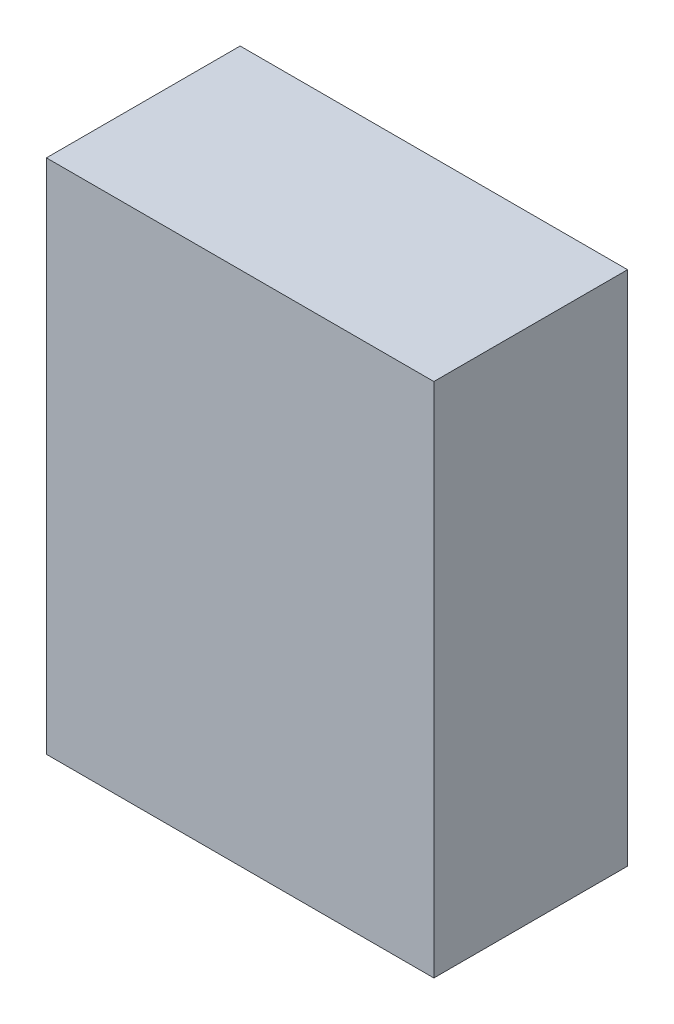
ISO-10303-21;
HEADER;
FILE_DESCRIPTION(('STEP AP214'),'2;1');
FILE_NAME('part.step','',(''),(''),'','','');
FILE_SCHEMA(('AUTOMOTIVE_DESIGN { 1 0 10303 214 1 1 1 1 }'));
ENDSEC;
DATA;
#1=APPLICATION_CONTEXT('core data for automotive mechanical design processes');
#2=APPLICATION_PROTOCOL_DEFINITION('international standard','automotive_design',2000,#1);
#3=PRODUCT_CONTEXT('',#1,'mechanical');
#4=PRODUCT('Part','Part','',(#3));
#5=PRODUCT_RELATED_PRODUCT_CATEGORY('part','',(#4));
#6=PRODUCT_DEFINITION_FORMATION('','',#4);
#7=PRODUCT_DEFINITION_CONTEXT('part definition',#1,'design');
#8=PRODUCT_DEFINITION('design','',#6,#7);
#9=PRODUCT_DEFINITION_SHAPE('','',#8);
#10=(LENGTH_UNIT() NAMED_UNIT(*) SI_UNIT(.MILLI.,.METRE.));
#11=(NAMED_UNIT(*) PLANE_ANGLE_UNIT() SI_UNIT($,.RADIAN.));
#12=(NAMED_UNIT(*) SI_UNIT($,.STERADIAN.) SOLID_ANGLE_UNIT());
#13=UNCERTAINTY_MEASURE_WITH_UNIT(LENGTH_MEASURE(1.E-05),#10,'distance_accuracy_value','');
#14=(GEOMETRIC_REPRESENTATION_CONTEXT(3) GLOBAL_UNCERTAINTY_ASSIGNED_CONTEXT((#13)) GLOBAL_UNIT_ASSIGNED_CONTEXT((#10,
#11,#12)) REPRESENTATION_CONTEXT('',''));
#15=CARTESIAN_POINT('',(0.,0.,0.));
#16=DIRECTION('',(0.,0.,1.));
#17=DIRECTION('',(1.,0.,0.));
#18=AXIS2_PLACEMENT_3D('',#15,#16,#17);
#19=CARTESIAN_POINT('',(750.,2000.,-375.));
#20=DIRECTION('',(-1.,0.,0.));
#21=DIRECTION('',(0.,0.,1.));
#22=AXIS2_PLACEMENT_3D('',#19,#20,#21);
#23=PLANE('',#22);
#24=DIRECTION('',(0.,0.,-1.));
#25=VECTOR('',#24,1.);
#26=CARTESIAN_POINT('',(750.,0.,-375.));
#27=LINE('',#26,#25);
#28=CARTESIAN_POINT('',(750.,0.,375.));
#29=VERTEX_POINT('',#28);
#30=CARTESIAN_POINT('',(750.,0.,-375.));
#31=VERTEX_POINT('',#30);
#32=EDGE_CURVE('E96',#29,#31,#27,.T.);
#33=ORIENTED_EDGE('',*,*,#32,.T.);
#34=DIRECTION('',(0.,-1.,0.));
#35=VECTOR('',#34,1.);
#36=CARTESIAN_POINT('',(750.,2000.,-375.));
#37=LINE('',#36,#35);
#38=CARTESIAN_POINT('',(750.,2000.,-375.));
#39=VERTEX_POINT('',#38);
#40=EDGE_CURVE('E11',#39,#31,#37,.T.);
#41=ORIENTED_EDGE('',*,*,#40,.F.);
#42=DIRECTION('',(0.,0.,-1.));
#43=VECTOR('',#42,1.);
#44=CARTESIAN_POINT('',(750.,2000.,-375.));
#45=LINE('',#44,#43);
#46=CARTESIAN_POINT('',(750.,2000.,375.));
#47=VERTEX_POINT('',#46);
#48=EDGE_CURVE('E84',#47,#39,#45,.T.);
#49=ORIENTED_EDGE('',*,*,#48,.F.);
#50=DIRECTION('',(0.,-1.,0.));
#51=VECTOR('',#50,1.);
#52=CARTESIAN_POINT('',(750.,2000.,375.));
#53=LINE('',#52,#51);
#54=EDGE_CURVE('E92',#47,#29,#53,.T.);
#55=ORIENTED_EDGE('',*,*,#54,.T.);
#56=EDGE_LOOP('',(#33,#41,#49,#55));
#57=FACE_BOUND('',#56,.T.);
#58=ADVANCED_FACE('F33',(#57),#23,.F.);
#59=CARTESIAN_POINT('',(-750.,2000.,-375.));
#60=DIRECTION('',(0.,0.,1.));
#61=DIRECTION('',(1.,0.,0.));
#62=AXIS2_PLACEMENT_3D('',#59,#60,#61);
#63=PLANE('',#62);
#64=DIRECTION('',(-1.,0.,0.));
#65=VECTOR('',#64,1.);
#66=CARTESIAN_POINT('',(-750.,0.,-375.));
#67=LINE('',#66,#65);
#68=CARTESIAN_POINT('',(-750.,0.,-375.));
#69=VERTEX_POINT('',#68);
#70=EDGE_CURVE('E88',#31,#69,#67,.T.);
#71=ORIENTED_EDGE('',*,*,#70,.T.);
#72=DIRECTION('',(0.,-1.,0.));
#73=VECTOR('',#72,1.);
#74=CARTESIAN_POINT('',(-750.,2000.,-375.));
#75=LINE('',#74,#73);
#76=CARTESIAN_POINT('',(-750.,2000.,-375.));
#77=VERTEX_POINT('',#76);
#78=EDGE_CURVE('E41',#77,#69,#75,.T.);
#79=ORIENTED_EDGE('',*,*,#78,.F.);
#80=DIRECTION('',(-1.,0.,0.));
#81=VECTOR('',#80,1.);
#82=CARTESIAN_POINT('',(-750.,2000.,-375.));
#83=LINE('',#82,#81);
#84=EDGE_CURVE('E79',#39,#77,#83,.T.);
#85=ORIENTED_EDGE('',*,*,#84,.F.);
#86=ORIENTED_EDGE('',*,*,#40,.T.);
#87=EDGE_LOOP('',(#71,#79,#85,#86));
#88=FACE_BOUND('',#87,.T.);
#89=ADVANCED_FACE('F87',(#88),#63,.F.);
#90=CARTESIAN_POINT('',(-750.,2000.,-375.));
#91=DIRECTION('',(1.,0.,0.));
#92=DIRECTION('',(0.,0.,-1.));
#93=AXIS2_PLACEMENT_3D('',#90,#91,#92);
#94=PLANE('',#93);
#95=DIRECTION('',(0.,0.,1.));
#96=VECTOR('',#95,1.);
#97=CARTESIAN_POINT('',(-750.,0.,-375.));
#98=LINE('',#97,#96);
#99=CARTESIAN_POINT('',(-750.,0.,375.));
#100=VERTEX_POINT('',#99);
#101=EDGE_CURVE('E66',#69,#100,#98,.T.);
#102=ORIENTED_EDGE('',*,*,#101,.T.);
#103=DIRECTION('',(0.,-1.,0.));
#104=VECTOR('',#103,1.);
#105=CARTESIAN_POINT('',(-750.,2000.,375.));
#106=LINE('',#105,#104);
#107=CARTESIAN_POINT('',(-750.,2000.,375.));
#108=VERTEX_POINT('',#107);
#109=EDGE_CURVE('E89',#108,#100,#106,.T.);
#110=ORIENTED_EDGE('',*,*,#109,.F.);
#111=DIRECTION('',(0.,0.,1.));
#112=VECTOR('',#111,1.);
#113=CARTESIAN_POINT('',(-750.,2000.,-375.));
#114=LINE('',#113,#112);
#115=EDGE_CURVE('E82',#77,#108,#114,.T.);
#116=ORIENTED_EDGE('',*,*,#115,.F.);
#117=ORIENTED_EDGE('',*,*,#78,.T.);
#118=EDGE_LOOP('',(#102,#110,#116,#117));
#119=FACE_BOUND('',#118,.T.);
#120=ADVANCED_FACE('F90',(#119),#94,.F.);
#121=CARTESIAN_POINT('',(-750.,2000.,375.));
#122=DIRECTION('',(0.,0.,-1.));
#123=DIRECTION('',(-1.,0.,0.));
#124=AXIS2_PLACEMENT_3D('',#121,#122,#123);
#125=PLANE('',#124);
#126=DIRECTION('',(1.,0.,0.));
#127=VECTOR('',#126,1.);
#128=CARTESIAN_POINT('',(-750.,0.,375.));
#129=LINE('',#128,#127);
#130=EDGE_CURVE('E72',#100,#29,#129,.T.);
#131=ORIENTED_EDGE('',*,*,#130,.T.);
#132=ORIENTED_EDGE('',*,*,#54,.F.);
#133=DIRECTION('',(1.,0.,0.));
#134=VECTOR('',#133,1.);
#135=CARTESIAN_POINT('',(-750.,2000.,375.));
#136=LINE('',#135,#134);
#137=EDGE_CURVE('E49',#108,#47,#136,.T.);
#138=ORIENTED_EDGE('',*,*,#137,.F.);
#139=ORIENTED_EDGE('',*,*,#109,.T.);
#140=EDGE_LOOP('',(#131,#132,#138,#139));
#141=FACE_BOUND('',#140,.T.);
#142=ADVANCED_FACE('F103',(#141),#125,.F.);
#143=CARTESIAN_POINT('',(0.,2000.,0.));
#144=DIRECTION('',(0.,1.,0.));
#145=DIRECTION('',(0.,0.,1.));
#146=AXIS2_PLACEMENT_3D('',#143,#144,#145);
#147=PLANE('',#146);
#148=ORIENTED_EDGE('',*,*,#48,.T.);
#149=ORIENTED_EDGE('',*,*,#84,.T.);
#150=ORIENTED_EDGE('',*,*,#115,.T.);
#151=ORIENTED_EDGE('',*,*,#137,.T.);
#152=EDGE_LOOP('',(#148,#149,#150,#151));
#153=FACE_BOUND('',#152,.T.);
#154=ADVANCED_FACE('F80',(#153),#147,.T.);
#155=CARTESIAN_POINT('',(0.,0.,0.));
#156=DIRECTION('',(0.,1.,0.));
#157=DIRECTION('',(0.,0.,1.));
#158=AXIS2_PLACEMENT_3D('',#155,#156,#157);
#159=PLANE('',#158);
#160=ORIENTED_EDGE('',*,*,#32,.F.);
#161=ORIENTED_EDGE('',*,*,#130,.F.);
#162=ORIENTED_EDGE('',*,*,#101,.F.);
#163=ORIENTED_EDGE('',*,*,#70,.F.);
#164=EDGE_LOOP('',(#160,#161,#162,#163));
#165=FACE_BOUND('',#164,.T.);
#166=ADVANCED_FACE('F106',(#165),#159,.F.);
#167=CLOSED_SHELL('',(#58,#89,#120,#142,#154,#166));
#168=MANIFOLD_SOLID_BREP('B2',#167);
#169=ADVANCED_BREP_SHAPE_REPRESENTATION('',(#18,#168),#14);
#170=SHAPE_DEFINITION_REPRESENTATION(#9,#169);
ENDSEC;
END-ISO-10303-21;
